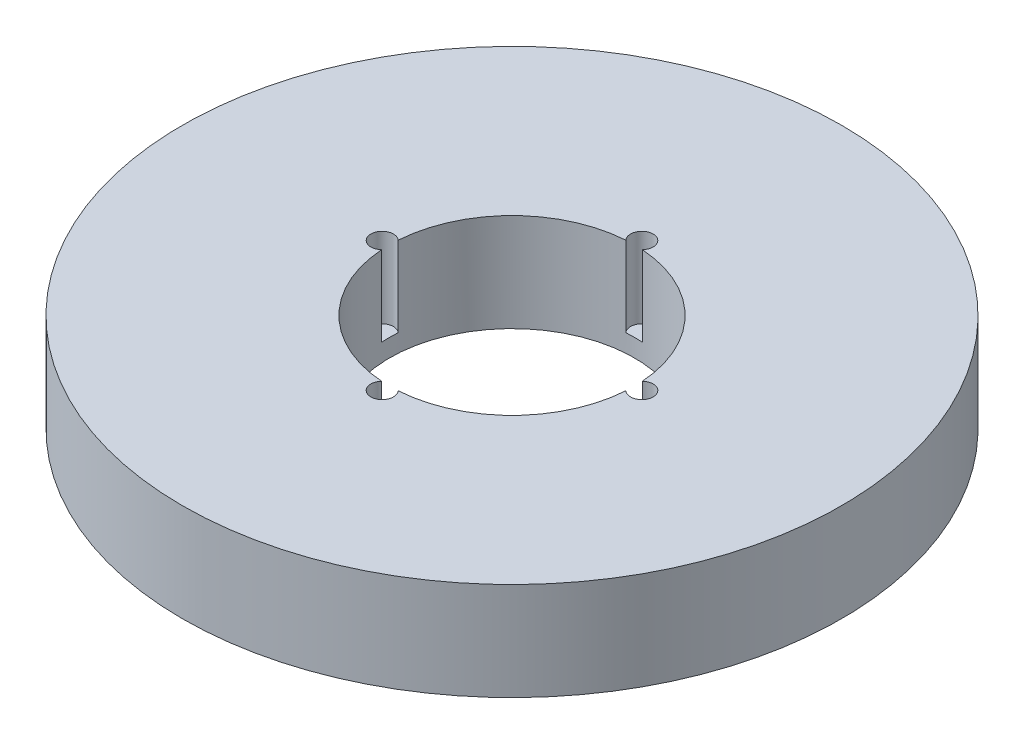
ISO-10303-21;
HEADER;
FILE_DESCRIPTION(('STEP AP214'),'2;1');
FILE_NAME('part.step','',(''),(''),'','','');
FILE_SCHEMA(('AUTOMOTIVE_DESIGN { 1 0 10303 214 1 1 1 1 }'));
ENDSEC;
DATA;
#1=APPLICATION_CONTEXT('core data for automotive mechanical design processes');
#2=APPLICATION_PROTOCOL_DEFINITION('international standard','automotive_design',2000,#1);
#3=PRODUCT_CONTEXT('',#1,'mechanical');
#4=PRODUCT('Part','Part','',(#3));
#5=PRODUCT_RELATED_PRODUCT_CATEGORY('part','',(#4));
#6=PRODUCT_DEFINITION_FORMATION('','',#4);
#7=PRODUCT_DEFINITION_CONTEXT('part definition',#1,'design');
#8=PRODUCT_DEFINITION('design','',#6,#7);
#9=PRODUCT_DEFINITION_SHAPE('','',#8);
#10=(LENGTH_UNIT() NAMED_UNIT(*) SI_UNIT(.MILLI.,.METRE.));
#11=(NAMED_UNIT(*) PLANE_ANGLE_UNIT() SI_UNIT($,.RADIAN.));
#12=(NAMED_UNIT(*) SI_UNIT($,.STERADIAN.) SOLID_ANGLE_UNIT());
#13=UNCERTAINTY_MEASURE_WITH_UNIT(LENGTH_MEASURE(1.E-05),#10,'distance_accuracy_value','');
#14=(GEOMETRIC_REPRESENTATION_CONTEXT(3) GLOBAL_UNCERTAINTY_ASSIGNED_CONTEXT((#13)) GLOBAL_UNIT_ASSIGNED_CONTEXT((#10,
#11,#12)) REPRESENTATION_CONTEXT('',''));
#15=CARTESIAN_POINT('',(0.,0.,0.));
#16=DIRECTION('',(0.,0.,1.));
#17=DIRECTION('',(1.,0.,0.));
#18=AXIS2_PLACEMENT_3D('',#15,#16,#17);
#19=CARTESIAN_POINT('',(0.,26.,0.));
#20=DIRECTION('',(0.,-1.,0.));
#21=DIRECTION('',(0.,0.,-1.));
#22=AXIS2_PLACEMENT_3D('',#19,#20,#21);
#23=CYLINDRICAL_SURFACE('',#22,87.5);
#24=CARTESIAN_POINT('',(0.,26.,0.));
#25=DIRECTION('',(0.,1.,0.));
#26=DIRECTION('',(0.,0.,1.));
#27=AXIS2_PLACEMENT_3D('',#24,#25,#26);
#28=CIRCLE('',#27,87.5);
#29=CARTESIAN_POINT('',(0.,26.,-87.5));
#30=VERTEX_POINT('',#29);
#31=EDGE_CURVE('E145',#30,#30,#28,.T.);
#32=CARTESIAN_POINT('',(0.,0.,0.));
#33=DIRECTION('',(0.,1.,0.));
#34=DIRECTION('',(0.,0.,1.));
#35=AXIS2_PLACEMENT_3D('',#32,#33,#34);
#36=CIRCLE('',#35,87.5);
#37=CARTESIAN_POINT('',(0.,0.,-87.5));
#38=VERTEX_POINT('',#37);
#39=EDGE_CURVE('E143',#38,#38,#36,.T.);
#40=CARTESIAN_POINT('',(0.,26.,-87.5));
#41=CARTESIAN_POINT('',(0.,25.7291666666667,-87.5));
#42=CARTESIAN_POINT('',(0.,25.4583333333333,-87.5));
#43=CARTESIAN_POINT('',(0.,24.9166666666667,-87.5));
#44=CARTESIAN_POINT('',(0.,24.6458333333333,-87.5));
#45=CARTESIAN_POINT('',(0.,24.1041666666667,-87.5));
#46=CARTESIAN_POINT('',(0.,23.8333333333333,-87.5));
#47=CARTESIAN_POINT('',(0.,23.2916666666667,-87.5));
#48=CARTESIAN_POINT('',(0.,23.0208333333333,-87.5));
#49=CARTESIAN_POINT('',(0.,22.4791666666667,-87.5));
#50=CARTESIAN_POINT('',(0.,22.2083333333333,-87.5));
#51=CARTESIAN_POINT('',(0.,21.6666666666667,-87.5));
#52=CARTESIAN_POINT('',(0.,21.3958333333333,-87.5));
#53=CARTESIAN_POINT('',(0.,20.8541666666667,-87.5));
#54=CARTESIAN_POINT('',(0.,20.5833333333333,-87.5));
#55=CARTESIAN_POINT('',(0.,20.0416666666667,-87.5));
#56=CARTESIAN_POINT('',(0.,19.7708333333333,-87.5));
#57=CARTESIAN_POINT('',(0.,19.2291666666667,-87.5));
#58=CARTESIAN_POINT('',(0.,18.9583333333333,-87.5));
#59=CARTESIAN_POINT('',(0.,18.4166666666667,-87.5));
#60=CARTESIAN_POINT('',(0.,18.1458333333333,-87.5));
#61=CARTESIAN_POINT('',(0.,17.6041666666667,-87.5));
#62=CARTESIAN_POINT('',(0.,17.3333333333333,-87.5));
#63=CARTESIAN_POINT('',(0.,16.7916666666667,-87.5));
#64=CARTESIAN_POINT('',(0.,16.5208333333333,-87.5));
#65=CARTESIAN_POINT('',(0.,15.9791666666667,-87.5));
#66=CARTESIAN_POINT('',(0.,15.7083333333333,-87.5));
#67=CARTESIAN_POINT('',(0.,15.1666666666667,-87.5));
#68=CARTESIAN_POINT('',(0.,14.8958333333333,-87.5));
#69=CARTESIAN_POINT('',(0.,14.3541666666667,-87.5));
#70=CARTESIAN_POINT('',(0.,14.0833333333333,-87.5));
#71=CARTESIAN_POINT('',(0.,13.5416666666667,-87.5));
#72=CARTESIAN_POINT('',(0.,13.2708333333333,-87.5));
#73=CARTESIAN_POINT('',(0.,12.7291666666667,-87.5));
#74=CARTESIAN_POINT('',(0.,12.4583333333333,-87.5));
#75=CARTESIAN_POINT('',(0.,11.9166666666667,-87.5));
#76=CARTESIAN_POINT('',(0.,11.6458333333333,-87.5));
#77=CARTESIAN_POINT('',(0.,11.1041666666667,-87.5));
#78=CARTESIAN_POINT('',(0.,10.8333333333333,-87.5));
#79=CARTESIAN_POINT('',(0.,10.2916666666667,-87.5));
#80=CARTESIAN_POINT('',(0.,10.0208333333333,-87.5));
#81=CARTESIAN_POINT('',(0.,9.47916666666667,-87.5));
#82=CARTESIAN_POINT('',(0.,9.20833333333333,-87.5));
#83=CARTESIAN_POINT('',(0.,8.66666666666667,-87.5));
#84=CARTESIAN_POINT('',(0.,8.39583333333333,-87.5));
#85=CARTESIAN_POINT('',(0.,7.85416666666667,-87.5));
#86=CARTESIAN_POINT('',(0.,7.58333333333333,-87.5));
#87=CARTESIAN_POINT('',(0.,7.04166666666667,-87.5));
#88=CARTESIAN_POINT('',(0.,6.77083333333333,-87.5));
#89=CARTESIAN_POINT('',(0.,6.22916666666667,-87.5));
#90=CARTESIAN_POINT('',(0.,5.95833333333333,-87.5));
#91=CARTESIAN_POINT('',(0.,5.41666666666667,-87.5));
#92=CARTESIAN_POINT('',(0.,5.14583333333333,-87.5));
#93=CARTESIAN_POINT('',(0.,4.60416666666667,-87.5));
#94=CARTESIAN_POINT('',(0.,4.33333333333333,-87.5));
#95=CARTESIAN_POINT('',(0.,3.79166666666667,-87.5));
#96=CARTESIAN_POINT('',(0.,3.52083333333333,-87.5));
#97=CARTESIAN_POINT('',(0.,2.97916666666667,-87.5));
#98=CARTESIAN_POINT('',(0.,2.70833333333333,-87.5));
#99=CARTESIAN_POINT('',(0.,2.16666666666667,-87.5));
#100=CARTESIAN_POINT('',(0.,1.89583333333333,-87.5));
#101=CARTESIAN_POINT('',(0.,1.35416666666667,-87.5));
#102=CARTESIAN_POINT('',(0.,1.08333333333333,-87.5));
#103=CARTESIAN_POINT('',(0.,0.541666666666667,-87.5));
#104=CARTESIAN_POINT('',(0.,0.270833333333334,-87.5));
#105=CARTESIAN_POINT('',(0.,0.,-87.5));
#106=B_SPLINE_CURVE_WITH_KNOTS('',3,(#40,#41,#42,#43,#44,#45,#46,#47,#48,#49,#50,#51,#52,#53,
#54,#55,#56,#57,#58,#59,#60,#61,#62,#63,#64,#65,#66,#67,#68,#69,#70,#71,#72,#73,#74,#75,#76,#77,
#78,#79,#80,#81,#82,#83,#84,#85,#86,#87,#88,#89,#90,#91,#92,#93,#94,#95,#96,#97,#98,#99,#100,
#101,#102,#103,#104,#105),.UNSPECIFIED.,.F.,.F.,(4,2,2,2,2,2,2,2,2,2,2,2,2,2,2,2,2,2,2,2,2,2,2,
2,2,2,2,2,2,2,2,2,4),(0.,0.812500000000001,1.625,2.4375,3.25,4.0625,4.875,5.6875,6.5,7.3125,
8.125,8.9375,9.75,10.5625,11.375,12.1875,13.,13.8125,14.625,15.4375,16.25,17.0625,17.875,
18.6875,19.5,20.3125,21.125,21.9375,22.75,23.5625,24.375,25.1875,26.),.UNSPECIFIED.);
#107=EDGE_CURVE('BSEAM39',#30,#38,#106,.T.);
#108=ORIENTED_EDGE('',*,*,#31,.F.);
#109=ORIENTED_EDGE('',*,*,#39,.T.);
#110=ORIENTED_EDGE('',*,*,#107,.T.);
#111=ORIENTED_EDGE('',*,*,#107,.F.);
#112=EDGE_LOOP('',(#108,#110,#109,#111));
#113=FACE_BOUND('',#112,.T.);
#114=ADVANCED_FACE('F39',(#113),#23,.T.);
#115=CARTESIAN_POINT('',(0.,26.,0.));
#116=DIRECTION('',(0.,1.,0.));
#117=DIRECTION('',(0.,0.,1.));
#118=AXIS2_PLACEMENT_3D('',#115,#116,#117);
#119=PLANE('',#118);
#120=CARTESIAN_POINT('',(1.20376050329048E-13,26.,34.4770710900987));
#121=DIRECTION('',(0.,1.,0.));
#122=DIRECTION('',(1.,0.,0.));
#123=AXIS2_PLACEMENT_3D('',#120,#121,#122);
#124=CIRCLE('',#123,2.99476695529005);
#125=CARTESIAN_POINT('',(-2.18272343199703,26.,32.4266205210998));
#126=VERTEX_POINT('',#125);
#127=CARTESIAN_POINT('',(2.18272343199726,26.,32.4266205210998));
#128=VERTEX_POINT('',#127);
#129=EDGE_CURVE('E152',#126,#128,#124,.T.);
#130=ORIENTED_EDGE('',*,*,#129,.F.);
#131=CARTESIAN_POINT('',(0.,26.,0.));
#132=DIRECTION('',(0.,1.,0.));
#133=DIRECTION('',(0.,0.,1.));
#134=AXIS2_PLACEMENT_3D('',#131,#132,#133);
#135=CIRCLE('',#134,32.5);
#136=CARTESIAN_POINT('',(-32.4266205210998,26.,2.18272343199714));
#137=VERTEX_POINT('',#136);
#138=EDGE_CURVE('E133',#137,#126,#135,.T.);
#139=ORIENTED_EDGE('',*,*,#138,.F.);
#140=CARTESIAN_POINT('',(-34.4770710900987,26.,0.));
#141=DIRECTION('',(0.,1.,0.));
#142=DIRECTION('',(0.,0.,1.));
#143=AXIS2_PLACEMENT_3D('',#140,#141,#142);
#144=CIRCLE('',#143,2.99476695529005);
#145=CARTESIAN_POINT('',(-32.4266205210998,26.,-2.18272343199714));
#146=VERTEX_POINT('',#145);
#147=EDGE_CURVE('E128',#146,#137,#144,.T.);
#148=ORIENTED_EDGE('',*,*,#147,.F.);
#149=CARTESIAN_POINT('',(-2.18272343199748,26.,-32.4266205210998));
#150=VERTEX_POINT('',#149);
#151=EDGE_CURVE('E121',#150,#146,#135,.T.);
#152=ORIENTED_EDGE('',*,*,#151,.F.);
#153=CARTESIAN_POINT('',(-3.61128150987143E-13,26.,-34.4770710900987));
#154=DIRECTION('',(0.,1.,0.));
#155=DIRECTION('',(-1.,0.,0.));
#156=AXIS2_PLACEMENT_3D('',#153,#154,#155);
#157=CIRCLE('',#156,2.99476695529005);
#158=CARTESIAN_POINT('',(2.1827234319968,26.,-32.4266205210998));
#159=VERTEX_POINT('',#158);
#160=EDGE_CURVE('E105',#159,#150,#157,.T.);
#161=ORIENTED_EDGE('',*,*,#160,.F.);
#162=CARTESIAN_POINT('',(32.4266205210998,26.,-2.18272343199714));
#163=VERTEX_POINT('',#162);
#164=EDGE_CURVE('E131',#163,#159,#135,.T.);
#165=ORIENTED_EDGE('',*,*,#164,.F.);
#166=CARTESIAN_POINT('',(34.4770710900987,26.,0.));
#167=DIRECTION('',(0.,1.,0.));
#168=DIRECTION('',(0.,0.,-1.));
#169=AXIS2_PLACEMENT_3D('',#166,#167,#168);
#170=CIRCLE('',#169,2.99476695529005);
#171=CARTESIAN_POINT('',(32.4266205210998,26.,2.18272343199714));
#172=VERTEX_POINT('',#171);
#173=EDGE_CURVE('E154',#172,#163,#170,.T.);
#174=ORIENTED_EDGE('',*,*,#173,.F.);
#175=EDGE_CURVE('E134',#128,#172,#135,.T.);
#176=ORIENTED_EDGE('',*,*,#175,.F.);
#177=EDGE_LOOP('',(#130,#139,#148,#152,#161,#165,#174,#176));
#178=FACE_BOUND('',#177,.T.);
#179=ORIENTED_EDGE('',*,*,#31,.T.);
#180=EDGE_LOOP('',(#179));
#181=FACE_BOUND('',#180,.T.);
#182=ADVANCED_FACE('F130',(#178,#181),#119,.T.);
#183=CARTESIAN_POINT('',(0.,0.,0.));
#184=DIRECTION('',(0.,1.,0.));
#185=DIRECTION('',(0.,0.,1.));
#186=AXIS2_PLACEMENT_3D('',#183,#184,#185);
#187=PLANE('',#186);
#188=CARTESIAN_POINT('',(0.,0.,0.));
#189=DIRECTION('',(0.,1.,0.));
#190=DIRECTION('',(0.,0.,1.));
#191=AXIS2_PLACEMENT_3D('',#188,#189,#190);
#192=CIRCLE('',#191,32.5);
#193=CARTESIAN_POINT('',(0.,0.,32.5));
#194=VERTEX_POINT('',#193);
#195=EDGE_CURVE('E135',#194,#194,#192,.T.);
#196=ORIENTED_EDGE('',*,*,#195,.T.);
#197=EDGE_LOOP('',(#196));
#198=FACE_BOUND('',#197,.T.);
#199=ORIENTED_EDGE('',*,*,#39,.F.);
#200=EDGE_LOOP('',(#199));
#201=FACE_BOUND('',#200,.T.);
#202=ADVANCED_FACE('F195',(#198,#201),#187,.F.);
#203=CARTESIAN_POINT('',(0.,26.,0.));
#204=DIRECTION('',(0.,-1.,0.));
#205=DIRECTION('',(0.,0.,-1.));
#206=AXIS2_PLACEMENT_3D('',#203,#204,#205);
#207=CYLINDRICAL_SURFACE('',#206,32.5);
#208=DIRECTION('',(0.,1.,0.));
#209=VECTOR('',#208,1.);
#210=CARTESIAN_POINT('',(-2.182723431997,15.3588007925908,32.4266205210998));
#211=LINE('',#210,#209);
#212=CARTESIAN_POINT('',(-2.18272343199703,4.71760158518152,32.4266205210998));
#213=VERTEX_POINT('',#212);
#214=EDGE_CURVE('E11',#213,#126,#211,.T.);
#215=ORIENTED_EDGE('',*,*,#214,.F.);
#216=CARTESIAN_POINT('',(0.,4.71760158518152,0.));
#217=DIRECTION('',(0.,1.,0.));
#218=DIRECTION('',(0.,0.,1.));
#219=AXIS2_PLACEMENT_3D('',#216,#217,#218);
#220=CIRCLE('',#219,32.5);
#221=CARTESIAN_POINT('',(2.18272343199726,4.71760158518152,32.4266205210998));
#222=VERTEX_POINT('',#221);
#223=EDGE_CURVE('E169',#213,#222,#220,.T.);
#224=ORIENTED_EDGE('',*,*,#223,.T.);
#225=DIRECTION('',(0.,1.,0.));
#226=VECTOR('',#225,1.);
#227=CARTESIAN_POINT('',(2.18272343199723,15.3588007925908,32.4266205210998));
#228=LINE('',#227,#226);
#229=EDGE_CURVE('E46',#128,#222,#228,.F.);
#230=ORIENTED_EDGE('',*,*,#229,.F.);
#231=ORIENTED_EDGE('',*,*,#175,.T.);
#232=DIRECTION('',(0.,1.,0.));
#233=VECTOR('',#232,1.);
#234=CARTESIAN_POINT('',(32.4266205210998,15.3588007925908,2.18272343199711));
#235=LINE('',#234,#233);
#236=CARTESIAN_POINT('',(32.4266205210998,4.71760158518152,2.18272343199714));
#237=VERTEX_POINT('',#236);
#238=EDGE_CURVE('E151',#237,#172,#235,.T.);
#239=ORIENTED_EDGE('',*,*,#238,.F.);
#240=CARTESIAN_POINT('',(0.,4.71760158518152,0.));
#241=DIRECTION('',(0.,1.,0.));
#242=DIRECTION('',(0.,0.,1.));
#243=AXIS2_PLACEMENT_3D('',#240,#241,#242);
#244=CIRCLE('',#243,32.5);
#245=CARTESIAN_POINT('',(32.4266205210998,4.71760158518152,-2.18272343199714));
#246=VERTEX_POINT('',#245);
#247=EDGE_CURVE('E173',#237,#246,#244,.T.);
#248=ORIENTED_EDGE('',*,*,#247,.T.);
#249=DIRECTION('',(0.,1.,0.));
#250=VECTOR('',#249,1.);
#251=CARTESIAN_POINT('',(32.4266205210998,15.3588007925908,-2.18272343199711));
#252=LINE('',#251,#250);
#253=EDGE_CURVE('E168',#163,#246,#252,.F.);
#254=ORIENTED_EDGE('',*,*,#253,.F.);
#255=ORIENTED_EDGE('',*,*,#164,.T.);
#256=DIRECTION('',(0.,1.,0.));
#257=VECTOR('',#256,1.);
#258=CARTESIAN_POINT('',(2.18272343199677,15.3588007925908,-32.4266205210998));
#259=LINE('',#258,#257);
#260=CARTESIAN_POINT('',(2.1827234319968,4.71760158518152,-32.4266205210998));
#261=VERTEX_POINT('',#260);
#262=EDGE_CURVE('E108',#261,#159,#259,.T.);
#263=ORIENTED_EDGE('',*,*,#262,.F.);
#264=CARTESIAN_POINT('',(0.,4.71760158518152,0.));
#265=DIRECTION('',(0.,1.,0.));
#266=DIRECTION('',(0.,0.,1.));
#267=AXIS2_PLACEMENT_3D('',#264,#265,#266);
#268=CIRCLE('',#267,32.5);
#269=CARTESIAN_POINT('',(-2.18272343199748,4.71760158518152,-32.4266205210998));
#270=VERTEX_POINT('',#269);
#271=EDGE_CURVE('E122',#261,#270,#268,.T.);
#272=ORIENTED_EDGE('',*,*,#271,.T.);
#273=DIRECTION('',(0.,1.,0.));
#274=VECTOR('',#273,1.);
#275=CARTESIAN_POINT('',(-2.18272343199745,15.3588007925908,-32.4266205210997));
#276=LINE('',#275,#274);
#277=EDGE_CURVE('E106',#150,#270,#276,.F.);
#278=ORIENTED_EDGE('',*,*,#277,.F.);
#279=ORIENTED_EDGE('',*,*,#151,.T.);
#280=DIRECTION('',(0.,1.,0.));
#281=VECTOR('',#280,1.);
#282=CARTESIAN_POINT('',(-32.4266205210998,15.3588007925908,-2.18272343199711));
#283=LINE('',#282,#281);
#284=CARTESIAN_POINT('',(-32.4266205210998,4.71760158518152,-2.18272343199714));
#285=VERTEX_POINT('',#284);
#286=EDGE_CURVE('E177',#285,#146,#283,.T.);
#287=ORIENTED_EDGE('',*,*,#286,.F.);
#288=CARTESIAN_POINT('',(0.,4.71760158518152,0.));
#289=DIRECTION('',(0.,1.,0.));
#290=DIRECTION('',(0.,0.,1.));
#291=AXIS2_PLACEMENT_3D('',#288,#289,#290);
#292=CIRCLE('',#291,32.5);
#293=CARTESIAN_POINT('',(-32.4266205210998,4.71760158518152,2.18272343199714));
#294=VERTEX_POINT('',#293);
#295=EDGE_CURVE('E185',#285,#294,#292,.T.);
#296=ORIENTED_EDGE('',*,*,#295,.T.);
#297=DIRECTION('',(0.,1.,0.));
#298=VECTOR('',#297,1.);
#299=CARTESIAN_POINT('',(-32.4266205210998,15.3588007925908,2.18272343199711));
#300=LINE('',#299,#298);
#301=EDGE_CURVE('E179',#137,#294,#300,.F.);
#302=ORIENTED_EDGE('',*,*,#301,.F.);
#303=ORIENTED_EDGE('',*,*,#138,.T.);
#304=EDGE_LOOP('',(#215,#224,#230,#231,#239,#248,#254,#255,#263,#272,#278,#279,#287,#296,#302,#303));
#305=FACE_BOUND('',#304,.T.);
#306=ORIENTED_EDGE('',*,*,#195,.F.);
#307=EDGE_LOOP('',(#306));
#308=FACE_BOUND('',#307,.T.);
#309=ADVANCED_FACE('F117',(#305,#308),#207,.F.);
#310=CARTESIAN_POINT('',(-34.4770710900987,4.71760158518152,0.));
#311=DIRECTION('',(0.,1.,0.));
#312=DIRECTION('',(0.,0.,1.));
#313=AXIS2_PLACEMENT_3D('',#310,#311,#312);
#314=CYLINDRICAL_SURFACE('',#313,2.99476695529005);
#315=ORIENTED_EDGE('',*,*,#286,.T.);
#316=ORIENTED_EDGE('',*,*,#147,.T.);
#317=ORIENTED_EDGE('',*,*,#301,.T.);
#318=CARTESIAN_POINT('',(-34.4770710900987,4.71760158518152,0.));
#319=DIRECTION('',(0.,1.,0.));
#320=DIRECTION('',(0.,0.,1.));
#321=AXIS2_PLACEMENT_3D('',#318,#319,#320);
#322=CIRCLE('',#321,2.99476695529005);
#323=EDGE_CURVE('E140',#285,#294,#322,.T.);
#324=ORIENTED_EDGE('',*,*,#323,.F.);
#325=EDGE_LOOP('',(#315,#316,#317,#324));
#326=FACE_BOUND('',#325,.T.);
#327=ADVANCED_FACE('F200',(#326),#314,.F.);
#328=CARTESIAN_POINT('',(-34.4770710900987,4.71760158518152,0.));
#329=DIRECTION('',(0.,1.,0.));
#330=DIRECTION('',(0.,0.,1.));
#331=AXIS2_PLACEMENT_3D('',#328,#329,#330);
#332=PLANE('',#331);
#333=ORIENTED_EDGE('',*,*,#323,.T.);
#334=ORIENTED_EDGE('',*,*,#295,.F.);
#335=EDGE_LOOP('',(#333,#334));
#336=FACE_BOUND('',#335,.T.);
#337=ADVANCED_FACE('F202',(#336),#332,.T.);
#338=CARTESIAN_POINT('',(-3.61128150987143E-13,4.71760158518152,-34.4770710900987));
#339=DIRECTION('',(0.,1.,0.));
#340=DIRECTION('',(0.,0.,1.));
#341=AXIS2_PLACEMENT_3D('',#338,#339,#340);
#342=CYLINDRICAL_SURFACE('',#341,2.99476695529005);
#343=ORIENTED_EDGE('',*,*,#262,.T.);
#344=ORIENTED_EDGE('',*,*,#160,.T.);
#345=ORIENTED_EDGE('',*,*,#277,.T.);
#346=CARTESIAN_POINT('',(-3.61128150987143E-13,4.71760158518152,-34.4770710900987));
#347=DIRECTION('',(0.,1.,0.));
#348=DIRECTION('',(-1.,0.,0.));
#349=AXIS2_PLACEMENT_3D('',#346,#347,#348);
#350=CIRCLE('',#349,2.99476695529005);
#351=EDGE_CURVE('E111',#261,#270,#350,.T.);
#352=ORIENTED_EDGE('',*,*,#351,.F.);
#353=EDGE_LOOP('',(#343,#344,#345,#352));
#354=FACE_BOUND('',#353,.T.);
#355=ADVANCED_FACE('F102',(#354),#342,.F.);
#356=CARTESIAN_POINT('',(-3.61128150987143E-13,4.71760158518152,-34.4770710900987));
#357=DIRECTION('',(0.,1.,0.));
#358=DIRECTION('',(-1.,0.,0.));
#359=AXIS2_PLACEMENT_3D('',#356,#357,#358);
#360=PLANE('',#359);
#361=ORIENTED_EDGE('',*,*,#351,.T.);
#362=ORIENTED_EDGE('',*,*,#271,.F.);
#363=EDGE_LOOP('',(#361,#362));
#364=FACE_BOUND('',#363,.T.);
#365=ADVANCED_FACE('F211',(#364),#360,.T.);
#366=CARTESIAN_POINT('',(34.4770710900987,4.71760158518152,0.));
#367=DIRECTION('',(0.,1.,0.));
#368=DIRECTION('',(0.,0.,1.));
#369=AXIS2_PLACEMENT_3D('',#366,#367,#368);
#370=CYLINDRICAL_SURFACE('',#369,2.99476695529005);
#371=ORIENTED_EDGE('',*,*,#238,.T.);
#372=ORIENTED_EDGE('',*,*,#173,.T.);
#373=ORIENTED_EDGE('',*,*,#253,.T.);
#374=CARTESIAN_POINT('',(34.4770710900987,4.71760158518152,0.));
#375=DIRECTION('',(0.,1.,0.));
#376=DIRECTION('',(0.,0.,-1.));
#377=AXIS2_PLACEMENT_3D('',#374,#375,#376);
#378=CIRCLE('',#377,2.99476695529005);
#379=EDGE_CURVE('E56',#237,#246,#378,.T.);
#380=ORIENTED_EDGE('',*,*,#379,.F.);
#381=EDGE_LOOP('',(#371,#372,#373,#380));
#382=FACE_BOUND('',#381,.T.);
#383=ADVANCED_FACE('F212',(#382),#370,.F.);
#384=CARTESIAN_POINT('',(34.4770710900987,4.71760158518152,0.));
#385=DIRECTION('',(0.,1.,0.));
#386=DIRECTION('',(0.,0.,-1.));
#387=AXIS2_PLACEMENT_3D('',#384,#385,#386);
#388=PLANE('',#387);
#389=ORIENTED_EDGE('',*,*,#379,.T.);
#390=ORIENTED_EDGE('',*,*,#247,.F.);
#391=EDGE_LOOP('',(#389,#390));
#392=FACE_BOUND('',#391,.T.);
#393=ADVANCED_FACE('F217',(#392),#388,.T.);
#394=CARTESIAN_POINT('',(1.20376050329048E-13,4.71760158518152,34.4770710900987));
#395=DIRECTION('',(0.,1.,0.));
#396=DIRECTION('',(0.,0.,1.));
#397=AXIS2_PLACEMENT_3D('',#394,#395,#396);
#398=CYLINDRICAL_SURFACE('',#397,2.99476695529005);
#399=ORIENTED_EDGE('',*,*,#214,.T.);
#400=ORIENTED_EDGE('',*,*,#129,.T.);
#401=ORIENTED_EDGE('',*,*,#229,.T.);
#402=CARTESIAN_POINT('',(1.20376050329048E-13,4.71760158518152,34.4770710900987));
#403=DIRECTION('',(0.,1.,0.));
#404=DIRECTION('',(1.,0.,0.));
#405=AXIS2_PLACEMENT_3D('',#402,#403,#404);
#406=CIRCLE('',#405,2.99476695529005);
#407=EDGE_CURVE('E55',#213,#222,#406,.T.);
#408=ORIENTED_EDGE('',*,*,#407,.F.);
#409=EDGE_LOOP('',(#399,#400,#401,#408));
#410=FACE_BOUND('',#409,.T.);
#411=ADVANCED_FACE('F170',(#410),#398,.F.);
#412=CARTESIAN_POINT('',(1.20376050329048E-13,4.71760158518152,34.4770710900987));
#413=DIRECTION('',(0.,1.,0.));
#414=DIRECTION('',(1.,0.,0.));
#415=AXIS2_PLACEMENT_3D('',#412,#413,#414);
#416=PLANE('',#415);
#417=ORIENTED_EDGE('',*,*,#407,.T.);
#418=ORIENTED_EDGE('',*,*,#223,.F.);
#419=EDGE_LOOP('',(#417,#418));
#420=FACE_BOUND('',#419,.T.);
#421=ADVANCED_FACE('F224',(#420),#416,.T.);
#422=CLOSED_SHELL('',(#114,#182,#202,#309,#327,#337,#355,#365,#383,#393,#411,#421));
#423=MANIFOLD_SOLID_BREP('B2',#422);
#424=ADVANCED_BREP_SHAPE_REPRESENTATION('',(#18,#423),#14);
#425=SHAPE_DEFINITION_REPRESENTATION(#9,#424);
ENDSEC;
END-ISO-10303-21;
